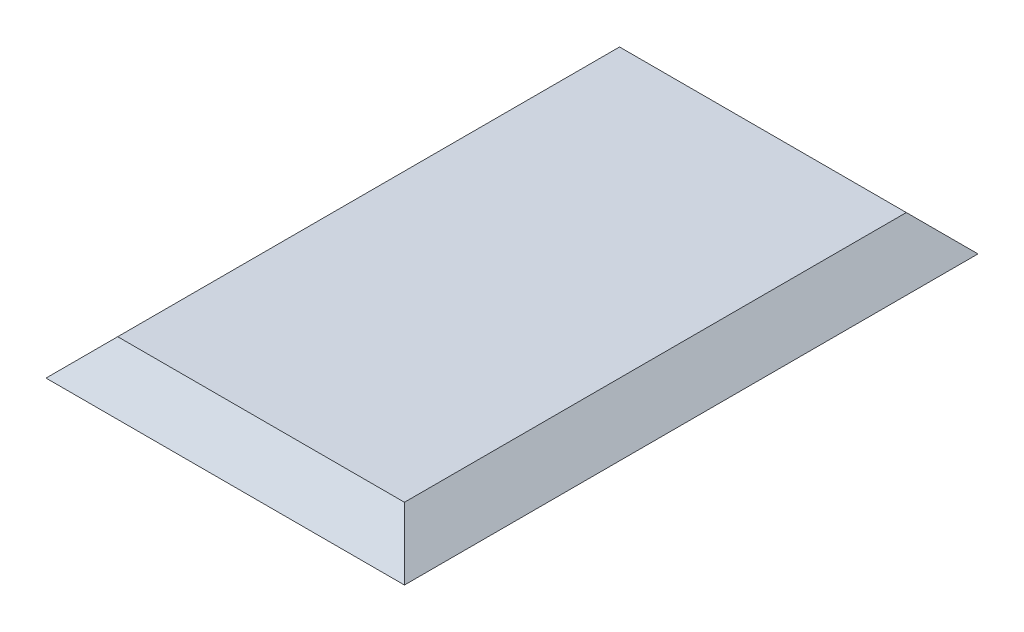
ISO-10303-21;
HEADER;
FILE_DESCRIPTION(('STEP AP214'),'2;1');
FILE_NAME('part.step','',(''),(''),'','','');
FILE_SCHEMA(('AUTOMOTIVE_DESIGN { 1 0 10303 214 1 1 1 1 }'));
ENDSEC;
DATA;
#1=APPLICATION_CONTEXT('core data for automotive mechanical design processes');
#2=APPLICATION_PROTOCOL_DEFINITION('international standard','automotive_design',2000,#1);
#3=PRODUCT_CONTEXT('',#1,'mechanical');
#4=PRODUCT('Part','Part','',(#3));
#5=PRODUCT_RELATED_PRODUCT_CATEGORY('part','',(#4));
#6=PRODUCT_DEFINITION_FORMATION('','',#4);
#7=PRODUCT_DEFINITION_CONTEXT('part definition',#1,'design');
#8=PRODUCT_DEFINITION('design','',#6,#7);
#9=PRODUCT_DEFINITION_SHAPE('','',#8);
#10=(LENGTH_UNIT() NAMED_UNIT(*) SI_UNIT(.MILLI.,.METRE.));
#11=(NAMED_UNIT(*) PLANE_ANGLE_UNIT() SI_UNIT($,.RADIAN.));
#12=(NAMED_UNIT(*) SI_UNIT($,.STERADIAN.) SOLID_ANGLE_UNIT());
#13=UNCERTAINTY_MEASURE_WITH_UNIT(LENGTH_MEASURE(1.E-05),#10,'distance_accuracy_value','');
#14=(GEOMETRIC_REPRESENTATION_CONTEXT(3) GLOBAL_UNCERTAINTY_ASSIGNED_CONTEXT((#13)) GLOBAL_UNIT_ASSIGNED_CONTEXT((#10,
#11,#12)) REPRESENTATION_CONTEXT('',''));
#15=CARTESIAN_POINT('',(0.,0.,0.));
#16=DIRECTION('',(0.,0.,1.));
#17=DIRECTION('',(1.,0.,0.));
#18=AXIS2_PLACEMENT_3D('',#15,#16,#17);
#19=CARTESIAN_POINT('',(0.,5.,0.));
#20=DIRECTION('',(0.,1.,0.));
#21=DIRECTION('',(0.,0.,1.));
#22=AXIS2_PLACEMENT_3D('',#19,#20,#21);
#23=PLANE('',#22);
#24=DIRECTION('',(1.,0.,0.));
#25=VECTOR('',#24,1.);
#26=CARTESIAN_POINT('',(-25.,5.00000000000001,35.));
#27=LINE('',#26,#25);
#28=CARTESIAN_POINT('',(-20.,5.,35.));
#29=VERTEX_POINT('',#28);
#30=CARTESIAN_POINT('',(19.9999999999999,5.00000000000001,35.));
#31=VERTEX_POINT('',#30);
#32=EDGE_CURVE('E47',#29,#31,#27,.T.);
#33=ORIENTED_EDGE('',*,*,#32,.T.);
#34=DIRECTION('',(0.,0.,1.));
#35=VECTOR('',#34,1.);
#36=CARTESIAN_POINT('',(20.,5.,-40.));
#37=LINE('',#36,#35);
#38=CARTESIAN_POINT('',(19.9999999999999,5.,-35.));
#39=VERTEX_POINT('',#38);
#40=EDGE_CURVE('E87',#39,#31,#37,.T.);
#41=ORIENTED_EDGE('',*,*,#40,.F.);
#42=DIRECTION('',(1.,0.,0.));
#43=VECTOR('',#42,1.);
#44=CARTESIAN_POINT('',(-25.,5.,-35.));
#45=LINE('',#44,#43);
#46=CARTESIAN_POINT('',(-20.,5.,-35.));
#47=VERTEX_POINT('',#46);
#48=EDGE_CURVE('E102',#47,#39,#45,.T.);
#49=ORIENTED_EDGE('',*,*,#48,.F.);
#50=DIRECTION('',(0.,0.,1.));
#51=VECTOR('',#50,1.);
#52=CARTESIAN_POINT('',(-20.,5.,-40.));
#53=LINE('',#52,#51);
#54=EDGE_CURVE('E90',#47,#29,#53,.T.);
#55=ORIENTED_EDGE('',*,*,#54,.T.);
#56=EDGE_LOOP('',(#33,#41,#49,#55));
#57=FACE_BOUND('',#56,.T.);
#58=ADVANCED_FACE('F32',(#57),#23,.T.);
#59=CARTESIAN_POINT('',(0.,0.,0.));
#60=DIRECTION('',(0.,1.,0.));
#61=DIRECTION('',(0.,0.,1.));
#62=AXIS2_PLACEMENT_3D('',#59,#60,#61);
#63=PLANE('',#62);
#64=DIRECTION('',(0.,0.,-1.));
#65=VECTOR('',#64,1.);
#66=CARTESIAN_POINT('',(25.,0.,-40.));
#67=LINE('',#66,#65);
#68=CARTESIAN_POINT('',(25.,0.,40.));
#69=VERTEX_POINT('',#68);
#70=CARTESIAN_POINT('',(25.,0.,-40.));
#71=VERTEX_POINT('',#70);
#72=EDGE_CURVE('E85',#69,#71,#67,.T.);
#73=ORIENTED_EDGE('',*,*,#72,.F.);
#74=DIRECTION('',(1.,0.,0.));
#75=VECTOR('',#74,1.);
#76=CARTESIAN_POINT('',(-25.,0.,40.));
#77=LINE('',#76,#75);
#78=CARTESIAN_POINT('',(-25.,0.,40.));
#79=VERTEX_POINT('',#78);
#80=EDGE_CURVE('E70',#79,#69,#77,.T.);
#81=ORIENTED_EDGE('',*,*,#80,.F.);
#82=DIRECTION('',(0.,0.,1.));
#83=VECTOR('',#82,1.);
#84=CARTESIAN_POINT('',(-25.,0.,-40.));
#85=LINE('',#84,#83);
#86=CARTESIAN_POINT('',(-25.,0.,-40.));
#87=VERTEX_POINT('',#86);
#88=EDGE_CURVE('E78',#87,#79,#85,.T.);
#89=ORIENTED_EDGE('',*,*,#88,.F.);
#90=DIRECTION('',(-1.,0.,0.));
#91=VECTOR('',#90,1.);
#92=CARTESIAN_POINT('',(-25.,0.,-40.));
#93=LINE('',#92,#91);
#94=EDGE_CURVE('E54',#71,#87,#93,.T.);
#95=ORIENTED_EDGE('',*,*,#94,.F.);
#96=EDGE_LOOP('',(#73,#81,#89,#95));
#97=FACE_BOUND('',#96,.T.);
#98=ADVANCED_FACE('F34',(#97),#63,.F.);
#99=CARTESIAN_POINT('',(25.,0.,-40.));
#100=DIRECTION('',(-0.707106781186543,-0.707106781186551,0.));
#101=DIRECTION('',(0.707106781186552,-0.707106781186544,0.));
#102=AXIS2_PLACEMENT_3D('',#99,#100,#101);
#103=PLANE('',#102);
#104=ORIENTED_EDGE('',*,*,#40,.T.);
#105=DIRECTION('',(0.57735026918963,-0.577350269189624,0.577350269189623));
#106=VECTOR('',#105,1.);
#107=CARTESIAN_POINT('',(-1.66666666666675,26.6666666666665,13.3333333333336));
#108=LINE('',#107,#106);
#109=EDGE_CURVE('E73',#31,#69,#108,.T.);
#110=ORIENTED_EDGE('',*,*,#109,.T.);
#111=ORIENTED_EDGE('',*,*,#72,.T.);
#112=DIRECTION('',(-0.577350269189628,0.577350269189622,0.577350269189628));
#113=VECTOR('',#112,1.);
#114=CARTESIAN_POINT('',(25.,0.,-40.));
#115=LINE('',#114,#113);
#116=EDGE_CURVE('E88',#71,#39,#115,.T.);
#117=ORIENTED_EDGE('',*,*,#116,.T.);
#118=EDGE_LOOP('',(#104,#110,#111,#117));
#119=FACE_BOUND('',#118,.T.);
#120=ADVANCED_FACE('F83',(#119),#103,.F.);
#121=CARTESIAN_POINT('',(-25.,0.,-40.));
#122=DIRECTION('',(0.707106781186549,-0.707106781186546,0.));
#123=DIRECTION('',(0.707106781186546,0.707106781186549,0.));
#124=AXIS2_PLACEMENT_3D('',#121,#122,#123);
#125=PLANE('',#124);
#126=ORIENTED_EDGE('',*,*,#88,.T.);
#127=DIRECTION('',(0.577350269189625,0.577350269189627,-0.577350269189626));
#128=VECTOR('',#127,1.);
#129=CARTESIAN_POINT('',(1.66666666666663,26.6666666666667,13.3333333333333));
#130=LINE('',#129,#128);
#131=EDGE_CURVE('E11',#79,#29,#130,.T.);
#132=ORIENTED_EDGE('',*,*,#131,.T.);
#133=ORIENTED_EDGE('',*,*,#54,.F.);
#134=DIRECTION('',(-0.577350269189622,-0.577350269189624,-0.577350269189631));
#135=VECTOR('',#134,1.);
#136=CARTESIAN_POINT('',(-25.,0.,-40.));
#137=LINE('',#136,#135);
#138=EDGE_CURVE('E40',#47,#87,#137,.T.);
#139=ORIENTED_EDGE('',*,*,#138,.T.);
#140=EDGE_LOOP('',(#126,#132,#133,#139));
#141=FACE_BOUND('',#140,.T.);
#142=ADVANCED_FACE('F99',(#141),#125,.F.);
#143=CARTESIAN_POINT('',(-25.,0.,-40.));
#144=DIRECTION('',(0.,-0.707106781186551,0.707106781186544));
#145=DIRECTION('',(0.,-0.707106781186544,-0.707106781186551));
#146=AXIS2_PLACEMENT_3D('',#143,#144,#145);
#147=PLANE('',#146);
#148=ORIENTED_EDGE('',*,*,#94,.T.);
#149=ORIENTED_EDGE('',*,*,#138,.F.);
#150=ORIENTED_EDGE('',*,*,#48,.T.);
#151=ORIENTED_EDGE('',*,*,#116,.F.);
#152=EDGE_LOOP('',(#148,#149,#150,#151));
#153=FACE_BOUND('',#152,.T.);
#154=ADVANCED_FACE('F101',(#153),#147,.F.);
#155=CARTESIAN_POINT('',(-25.,0.,40.));
#156=DIRECTION('',(0.,-0.707106781186547,-0.707106781186548));
#157=DIRECTION('',(0.,0.707106781186548,-0.707106781186547));
#158=AXIS2_PLACEMENT_3D('',#155,#156,#157);
#159=PLANE('',#158);
#160=ORIENTED_EDGE('',*,*,#32,.F.);
#161=ORIENTED_EDGE('',*,*,#131,.F.);
#162=ORIENTED_EDGE('',*,*,#80,.T.);
#163=ORIENTED_EDGE('',*,*,#109,.F.);
#164=EDGE_LOOP('',(#160,#161,#162,#163));
#165=FACE_BOUND('',#164,.T.);
#166=ADVANCED_FACE('F72',(#165),#159,.F.);
#167=CLOSED_SHELL('',(#58,#98,#120,#142,#154,#166));
#168=MANIFOLD_SOLID_BREP('B2',#167);
#169=ADVANCED_BREP_SHAPE_REPRESENTATION('',(#18,#168),#14);
#170=SHAPE_DEFINITION_REPRESENTATION(#9,#169);
ENDSEC;
END-ISO-10303-21;
